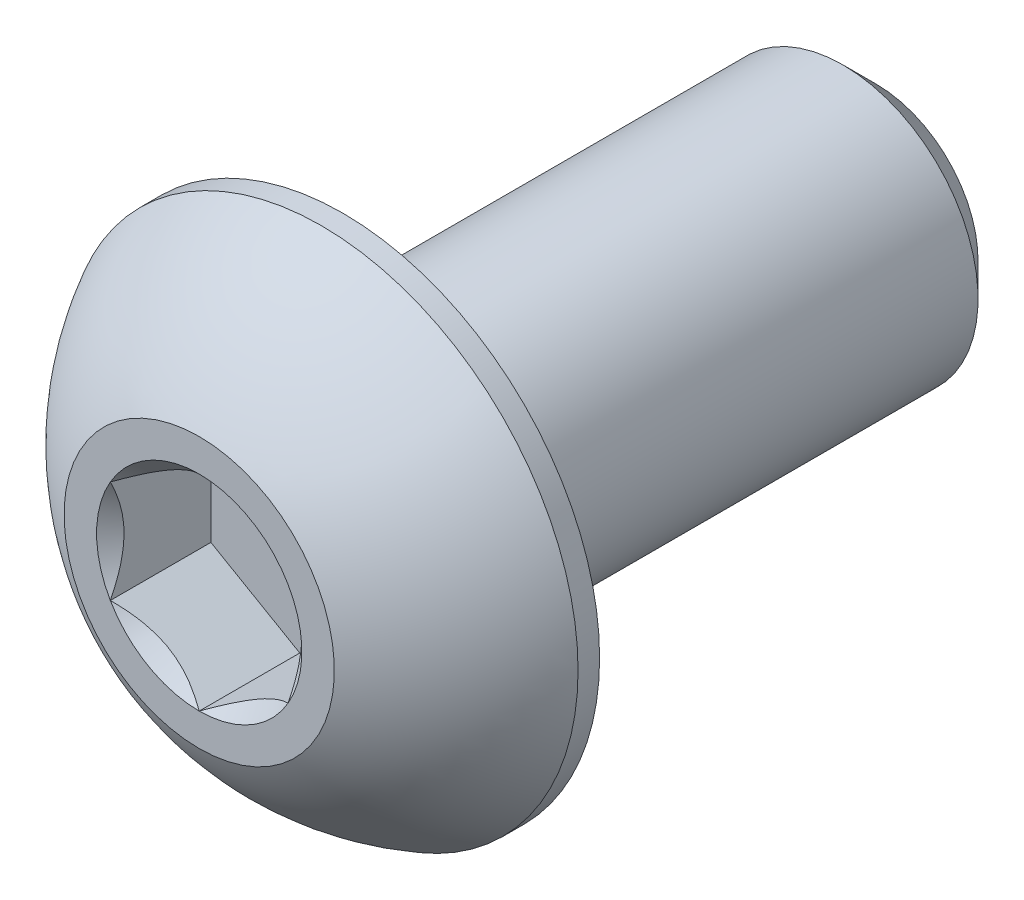
ISO-10303-21;
HEADER;
FILE_DESCRIPTION(('STEP AP214'),'2;1');
FILE_NAME('part.step','',(''),(''),'','','');
FILE_SCHEMA(('AUTOMOTIVE_DESIGN { 1 0 10303 214 1 1 1 1 }'));
ENDSEC;
DATA;
#1=APPLICATION_CONTEXT('core data for automotive mechanical design processes');
#2=APPLICATION_PROTOCOL_DEFINITION('international standard','automotive_design',2000,#1);
#3=PRODUCT_CONTEXT('',#1,'mechanical');
#4=PRODUCT('Part','Part','',(#3));
#5=PRODUCT_RELATED_PRODUCT_CATEGORY('part','',(#4));
#6=PRODUCT_DEFINITION_FORMATION('','',#4);
#7=PRODUCT_DEFINITION_CONTEXT('part definition',#1,'design');
#8=PRODUCT_DEFINITION('design','',#6,#7);
#9=PRODUCT_DEFINITION_SHAPE('','',#8);
#10=(LENGTH_UNIT() NAMED_UNIT(*) SI_UNIT(.MILLI.,.METRE.));
#11=(NAMED_UNIT(*) PLANE_ANGLE_UNIT() SI_UNIT($,.RADIAN.));
#12=(NAMED_UNIT(*) SI_UNIT($,.STERADIAN.) SOLID_ANGLE_UNIT());
#13=UNCERTAINTY_MEASURE_WITH_UNIT(LENGTH_MEASURE(1.E-05),#10,'distance_accuracy_value','');
#14=(GEOMETRIC_REPRESENTATION_CONTEXT(3) GLOBAL_UNCERTAINTY_ASSIGNED_CONTEXT((#13)) GLOBAL_UNIT_ASSIGNED_CONTEXT((#10,
#11,#12)) REPRESENTATION_CONTEXT('',''));
#15=CARTESIAN_POINT('',(0.,0.,0.));
#16=DIRECTION('',(0.,0.,1.));
#17=DIRECTION('',(1.,0.,0.));
#18=AXIS2_PLACEMENT_3D('',#15,#16,#17);
#19=CARTESIAN_POINT('',(0.,-2.41300000000001,-12.0904));
#20=DIRECTION('',(0.,0.,-1.));
#21=DIRECTION('',(0.,1.,0.));
#22=AXIS2_PLACEMENT_3D('',#19,#20,#21);
#23=PLANE('',#22);
#24=CARTESIAN_POINT('',(0.,0.,-12.0904));
#25=DIRECTION('',(0.,0.,-1.));
#26=DIRECTION('',(0.,1.,0.));
#27=AXIS2_PLACEMENT_3D('',#24,#25,#26);
#28=CIRCLE('',#27,1.8176875);
#29=CARTESIAN_POINT('',(0.,1.8176875,-12.0904));
#30=VERTEX_POINT('',#29);
#31=EDGE_CURVE('E43',#30,#30,#28,.T.);
#32=ORIENTED_EDGE('',*,*,#31,.T.);
#33=EDGE_LOOP('',(#32));
#34=FACE_BOUND('',#33,.T.);
#35=ADVANCED_FACE('F35',(#34),#23,.T.);
#36=CARTESIAN_POINT('',(0.,0.,-12.0904));
#37=DIRECTION('',(0.,0.,-1.));
#38=DIRECTION('',(0.,1.,0.));
#39=AXIS2_PLACEMENT_3D('',#36,#37,#38);
#40=CYLINDRICAL_SURFACE('',#39,2.41300000000001);
#41=CARTESIAN_POINT('',(0.,0.,-11.4950875));
#42=DIRECTION('',(0.,0.,-1.));
#43=DIRECTION('',(0.,1.,0.));
#44=AXIS2_PLACEMENT_3D('',#41,#42,#43);
#45=CIRCLE('',#44,2.41300000000001);
#46=CARTESIAN_POINT('',(0.,2.413,-11.4950875));
#47=VERTEX_POINT('',#46);
#48=EDGE_CURVE('E11',#47,#47,#45,.F.);
#49=ORIENTED_EDGE('',*,*,#48,.T.);
#50=EDGE_LOOP('',(#49));
#51=FACE_BOUND('',#50,.T.);
#52=CARTESIAN_POINT('',(0.,0.,-2.5654));
#53=DIRECTION('',(0.,0.,1.));
#54=DIRECTION('',(1.,0.,0.));
#55=AXIS2_PLACEMENT_3D('',#52,#53,#54);
#56=CIRCLE('',#55,2.41300000000001);
#57=CARTESIAN_POINT('',(2.41300000000001,0.,-2.5654));
#58=VERTEX_POINT('',#57);
#59=EDGE_CURVE('E169',#58,#58,#56,.F.);
#60=ORIENTED_EDGE('',*,*,#59,.T.);
#61=EDGE_LOOP('',(#60));
#62=FACE_BOUND('',#61,.T.);
#63=ADVANCED_FACE('F177',(#51,#62),#40,.T.);
#64=CARTESIAN_POINT('',(0.,0.,-12.0904));
#65=DIRECTION('',(0.,0.,1.));
#66=DIRECTION('',(0.,-1.,0.));
#67=AXIS2_PLACEMENT_3D('',#64,#65,#66);
#68=CONICAL_SURFACE('',#67,1.8176875,0.785398163397446);
#69=ORIENTED_EDGE('',*,*,#48,.F.);
#70=EDGE_LOOP('',(#69));
#71=FACE_BOUND('',#70,.T.);
#72=ORIENTED_EDGE('',*,*,#31,.F.);
#73=EDGE_LOOP('',(#72));
#74=FACE_BOUND('',#73,.T.);
#75=ADVANCED_FACE('F37',(#71,#74),#68,.T.);
#76=CARTESIAN_POINT('',(0.,0.,-4.5748806144438));
#77=DIRECTION('',(0.,0.,1.));
#78=DIRECTION('',(0.,-1.,0.));
#79=AXIS2_PLACEMENT_3D('',#76,#77,#78);
#80=SPHERICAL_SURFACE('',#79,5.17224338526463);
#81=CARTESIAN_POINT('',(0.,0.,0.));
#82=DIRECTION('',(0.,0.,1.));
#83=DIRECTION('',(1.,0.,0.));
#84=AXIS2_PLACEMENT_3D('',#81,#82,#83);
#85=CIRCLE('',#84,2.413);
#86=CARTESIAN_POINT('',(0.,-2.413,0.));
#87=VERTEX_POINT('',#86);
#88=EDGE_CURVE('E166',#87,#87,#85,.T.);
#89=CARTESIAN_POINT('',(0.,0.,-2.18059));
#90=DIRECTION('',(0.,0.,1.));
#91=DIRECTION('',(1.,0.,0.));
#92=AXIS2_PLACEMENT_3D('',#89,#90,#91);
#93=CIRCLE('',#92,4.5847);
#94=CARTESIAN_POINT('',(0.,-4.5847,-2.18059));
#95=VERTEX_POINT('',#94);
#96=EDGE_CURVE('E160',#95,#95,#93,.T.);
#97=CARTESIAN_POINT('',(0.,-2.413,0.));
#98=CARTESIAN_POINT('',(0.,-2.44179113663083,-0.0151857097788009));
#99=CARTESIAN_POINT('',(0.,-2.47043888331474,-0.0306432741933343));
#100=CARTESIAN_POINT('',(0.,-2.5274374690351,-0.0620964513369402));
#101=CARTESIAN_POINT('',(0.,-2.55578830807155,-0.0780920640660127));
#102=CARTESIAN_POINT('',(0.,-2.61218295074331,-0.110615676881771));
#103=CARTESIAN_POINT('',(0.,-2.64022675437863,-0.127143676968457));
#104=CARTESIAN_POINT('',(0.,-2.69599733629138,-0.160726162390165));
#105=CARTESIAN_POINT('',(0.,-2.72372411456882,-0.177780647725188));
#106=CARTESIAN_POINT('',(0.,-2.77885076121154,-0.21241002764294));
#107=CARTESIAN_POINT('',(0.,-2.80625062957682,-0.229984922225668));
#108=CARTESIAN_POINT('',(0.,-2.86071369040082,-0.265648855453746));
#109=CARTESIAN_POINT('',(0.,-2.88777688285954,-0.283737894099096));
#110=CARTESIAN_POINT('',(0.,-2.94155694533546,-0.320423667994127));
#111=CARTESIAN_POINT('',(0.,-2.96827381535265,-0.339020403243808));
#112=CARTESIAN_POINT('',(0.,-3.02135171000009,-0.37671494166065));
#113=CARTESIAN_POINT('',(0.,-3.04771273463033,-0.39581274482781));
#114=CARTESIAN_POINT('',(0.,-3.10006954235699,-0.434502611862808));
#115=CARTESIAN_POINT('',(0.,-3.12606532545341,-0.454094675730644));
#116=CARTESIAN_POINT('',(0.,-3.17768238416296,-0.493766080756604));
#117=CARTESIAN_POINT('',(0.,-3.20330365977609,-0.513845421914727));
#118=CARTESIAN_POINT('',(0.,-3.25416257105645,-0.554484224430573));
#119=CARTESIAN_POINT('',(0.,-3.27940020672367,-0.575043685788297));
#120=CARTESIAN_POINT('',(0.,-3.32948284239517,-0.616635400476975));
#121=CARTESIAN_POINT('',(0.,-3.35432784239946,-0.63766765380793));
#122=CARTESIAN_POINT('',(0.,-3.40361635097913,-0.680197455694829));
#123=CARTESIAN_POINT('',(0.,-3.42805985955453,-0.701695004250773));
#124=CARTESIAN_POINT('',(0.,-3.47653667261836,-0.745147733989217));
#125=CARTESIAN_POINT('',(0.,-3.5005699771068,-0.767102915171716));
#126=CARTESIAN_POINT('',(0.,-3.54821781555203,-0.81146308444603));
#127=CARTESIAN_POINT('',(0.,-3.57183234950881,-0.833868072537843));
#128=CARTESIAN_POINT('',(0.,-3.61863422971284,-0.879119869584105));
#129=CARTESIAN_POINT('',(0.,-3.64182157596008,-0.901966678538555));
#130=CARTESIAN_POINT('',(0.,-3.68776081583415,-0.948093973780533));
#131=CARTESIAN_POINT('',(0.,-3.71051270946098,-0.971374460068061));
#132=CARTESIAN_POINT('',(0.,-3.75557293439636,-1.01836081186645));
#133=CARTESIAN_POINT('',(0.,-3.7778812657049,-1.0420666773773));
#134=CARTESIAN_POINT('',(0.,-3.82204641440941,-1.08989533789018));
#135=CARTESIAN_POINT('',(0.,-3.84390323180538,-1.11401813289221));
#136=CARTESIAN_POINT('',(0.,-3.88715756202836,-1.16267205404467));
#137=CARTESIAN_POINT('',(0.,-3.90855507485536,-1.18720318019511));
#138=CARTESIAN_POINT('',(0.,-3.95088316899876,-1.23666501975588));
#139=CARTESIAN_POINT('',(0.,-3.97181375031515,-1.26159573316622));
#140=CARTESIAN_POINT('',(0.,-4.01320052092912,-1.31184786092909));
#141=CARTESIAN_POINT('',(0.,-4.03365671022669,-1.33716927528163));
#142=CARTESIAN_POINT('',(0.,-4.07408740538699,-1.38819377934977));
#143=CARTESIAN_POINT('',(0.,-4.09406191124973,-1.41389686906536));
#144=CARTESIAN_POINT('',(0.,-4.13352211981722,-1.46567556223513));
#145=CARTESIAN_POINT('',(0.,-4.15300782252198,-1.4917511656893));
#146=CARTESIAN_POINT('',(0.,-4.19148347927457,-1.54426559193551));
#147=CARTESIAN_POINT('',(0.,-4.2104734333224,-1.57070441472756));
#148=CARTESIAN_POINT('',(0.,-4.24795082398615,-1.6239358557723));
#149=CARTESIAN_POINT('',(0.,-4.26643826060207,-1.65072847402499));
#150=CARTESIAN_POINT('',(0.,-4.3029040266735,-1.70465795604563));
#151=CARTESIAN_POINT('',(0.,-4.32088235612901,-1.73179481981358));
#152=CARTESIAN_POINT('',(0.,-4.35632349988304,-1.78640312007115));
#153=CARTESIAN_POINT('',(0.,-4.37378631418156,-1.81387455656079));
#154=CARTESIAN_POINT('',(0.,-4.40819020238474,-1.86914221075438));
#155=CARTESIAN_POINT('',(0.,-4.42513127628939,-1.89693842845834));
#156=CARTESIAN_POINT('',(0.,-4.45848564813517,-1.95284573578717));
#157=CARTESIAN_POINT('',(0.,-4.4748989460763,-1.98095682541204));
#158=CARTESIAN_POINT('',(0.,-4.50719190474587,-2.03748386259807));
#159=CARTESIAN_POINT('',(0.,-4.5230715654743,-2.06589981015923));
#160=CARTESIAN_POINT('',(0.,-4.55429163018258,-2.12302641242262));
#161=CARTESIAN_POINT('',(0.,-4.56963203416241,-2.15173706712485));
#162=CARTESIAN_POINT('',(0.,-4.5847,-2.18059));
#163=B_SPLINE_CURVE_WITH_KNOTS('',3,(#97,#98,#99,#100,#101,#102,#103,#104,#105,#106,#107,#108,
#109,#110,#111,#112,#113,#114,#115,#116,#117,#118,#119,#120,#121,#122,#123,#124,#125,#126,#127,
#128,#129,#130,#131,#132,#133,#134,#135,#136,#137,#138,#139,#140,#141,#142,#143,#144,#145,#146,
#147,#148,#149,#150,#151,#152,#153,#154,#155,#156,#157,#158,#159,#160,#161,#162),.UNSPECIFIED.,
.F.,.F.,(4,2,2,2,2,2,2,2,2,2,2,2,2,2,2,2,2,2,2,2,2,2,2,2,2,2,2,2,2,2,2,2,4),(0.,
0.0976500604051489,0.195300120810298,0.292950181215447,0.390600241620598,0.488250302025747,
0.585900362430896,0.683550422836046,0.781200483241194,0.878850543646344,0.976500604051493,
1.07415066445664,1.17180072486179,1.26945078526694,1.36710084567209,1.46475090607724,
1.56240096648239,1.66005102688754,1.75770108729269,1.85535114769784,1.95300120810299,
2.05065126850814,2.14830132891329,2.24595138931843,2.34360144972358,2.44125151012873,
2.53890157053388,2.63655163093903,2.73420169134418,2.83185175174933,2.92950181215448,
3.02715187255963,3.12480193296478),.UNSPECIFIED.);
#164=EDGE_CURVE('BSEAM176',#87,#95,#163,.T.);
#165=ORIENTED_EDGE('',*,*,#88,.F.);
#166=ORIENTED_EDGE('',*,*,#96,.T.);
#167=ORIENTED_EDGE('',*,*,#164,.T.);
#168=ORIENTED_EDGE('',*,*,#164,.F.);
#169=EDGE_LOOP('',(#165,#167,#166,#168));
#170=FACE_BOUND('',#169,.T.);
#171=ADVANCED_FACE('F176',(#170),#80,.T.);
#172=CARTESIAN_POINT('',(0.,-2.413,0.));
#173=DIRECTION('',(0.,0.,-1.));
#174=DIRECTION('',(-1.,0.,0.));
#175=AXIS2_PLACEMENT_3D('',#172,#173,#174);
#176=PLANE('',#175);
#177=CARTESIAN_POINT('',(0.,0.,0.));
#178=DIRECTION('',(0.,0.,1.));
#179=DIRECTION('',(1.,0.,0.));
#180=AXIS2_PLACEMENT_3D('',#177,#178,#179);
#181=CIRCLE('',#180,1.83308710467706);
#182=CARTESIAN_POINT('',(-1.5875,0.91654355233853,0.));
#183=VERTEX_POINT('',#182);
#184=CARTESIAN_POINT('',(-1.5875,-0.916543552338531,0.));
#185=VERTEX_POINT('',#184);
#186=EDGE_CURVE('E56',#183,#185,#181,.T.);
#187=ORIENTED_EDGE('',*,*,#186,.F.);
#188=CARTESIAN_POINT('',(0.,1.83308710467706,0.));
#189=VERTEX_POINT('',#188);
#190=EDGE_CURVE('E130',#189,#183,#181,.T.);
#191=ORIENTED_EDGE('',*,*,#190,.F.);
#192=CARTESIAN_POINT('',(1.5875,0.916543552338531,0.));
#193=VERTEX_POINT('',#192);
#194=EDGE_CURVE('E107',#193,#189,#181,.T.);
#195=ORIENTED_EDGE('',*,*,#194,.F.);
#196=CARTESIAN_POINT('',(1.5875,-0.916543552338531,0.));
#197=VERTEX_POINT('',#196);
#198=EDGE_CURVE('E96',#197,#193,#181,.T.);
#199=ORIENTED_EDGE('',*,*,#198,.F.);
#200=CARTESIAN_POINT('',(0.,-1.83308710467706,0.));
#201=VERTEX_POINT('',#200);
#202=EDGE_CURVE('E88',#201,#197,#181,.T.);
#203=ORIENTED_EDGE('',*,*,#202,.F.);
#204=EDGE_CURVE('E49',#185,#201,#181,.T.);
#205=ORIENTED_EDGE('',*,*,#204,.F.);
#206=EDGE_LOOP('',(#187,#191,#195,#199,#203,#205));
#207=FACE_BOUND('',#206,.T.);
#208=ORIENTED_EDGE('',*,*,#88,.T.);
#209=EDGE_LOOP('',(#208));
#210=FACE_BOUND('',#209,.T.);
#211=ADVANCED_FACE('F127',(#207,#210),#176,.F.);
#212=CARTESIAN_POINT('',(0.,-4.5847,-2.5654));
#213=DIRECTION('',(0.,0.,1.));
#214=DIRECTION('',(1.,0.,0.));
#215=AXIS2_PLACEMENT_3D('',#212,#213,#214);
#216=PLANE('',#215);
#217=ORIENTED_EDGE('',*,*,#59,.F.);
#218=EDGE_LOOP('',(#217));
#219=FACE_BOUND('',#218,.T.);
#220=CARTESIAN_POINT('',(0.,0.,-2.5654));
#221=DIRECTION('',(0.,0.,1.));
#222=DIRECTION('',(1.,0.,0.));
#223=AXIS2_PLACEMENT_3D('',#220,#221,#222);
#224=CIRCLE('',#223,4.5847);
#225=CARTESIAN_POINT('',(4.5847,0.,-2.5654));
#226=VERTEX_POINT('',#225);
#227=EDGE_CURVE('E163',#226,#226,#224,.T.);
#228=ORIENTED_EDGE('',*,*,#227,.F.);
#229=EDGE_LOOP('',(#228));
#230=FACE_BOUND('',#229,.T.);
#231=ADVANCED_FACE('F194',(#219,#230),#216,.F.);
#232=CARTESIAN_POINT('',(0.,0.,0.));
#233=DIRECTION('',(0.,0.,1.));
#234=DIRECTION('',(1.,0.,0.));
#235=AXIS2_PLACEMENT_3D('',#232,#233,#234);
#236=CYLINDRICAL_SURFACE('',#235,4.5847);
#237=ORIENTED_EDGE('',*,*,#96,.F.);
#238=EDGE_LOOP('',(#237));
#239=FACE_BOUND('',#238,.T.);
#240=ORIENTED_EDGE('',*,*,#227,.T.);
#241=EDGE_LOOP('',(#240));
#242=FACE_BOUND('',#241,.T.);
#243=ADVANCED_FACE('F197',(#239,#242),#236,.T.);
#244=CARTESIAN_POINT('',(0.,0.,0.));
#245=DIRECTION('',(0.,0.,1.));
#246=DIRECTION('',(1.,0.,0.));
#247=AXIS2_PLACEMENT_3D('',#244,#245,#246);
#248=CONICAL_SURFACE('',#247,1.83308710467706,0.78539816339745);
#249=ORIENTED_EDGE('',*,*,#198,.T.);
#250=CARTESIAN_POINT('',(1.5875,-1.83163614232865,0.590762562254565));
#251=CARTESIAN_POINT('',(1.5875,-1.78705354844902,0.55707785480324));
#252=CARTESIAN_POINT('',(1.5875,-1.74222294150555,0.523722329968627));
#253=CARTESIAN_POINT('',(1.5875,-1.65196486784504,0.457805675888285));
#254=CARTESIAN_POINT('',(1.5875,-1.60653725449665,0.425244747634468));
#255=CARTESIAN_POINT('',(1.5875,-1.46854281940082,0.328493449461236));
#256=CARTESIAN_POINT('',(1.5875,-1.37494211623386,0.265753264612858));
#257=CARTESIAN_POINT('',(1.5875,-1.17864136265695,0.142553151294645));
#258=CARTESIAN_POINT('',(1.5875,-1.07572731596385,0.0824303289226488));
#259=CARTESIAN_POINT('',(1.5875,-0.864754189558117,-0.0275706334490079));
#260=CARTESIAN_POINT('',(1.5875,-0.756714033301438,-0.0774833149376714));
#261=CARTESIAN_POINT('',(1.5875,-0.594580029688666,-0.138547963751185));
#262=CARTESIAN_POINT('',(1.5875,-0.542894373932897,-0.156067797502568));
#263=CARTESIAN_POINT('',(1.5875,-0.43827206291756,-0.186958420156953));
#264=CARTESIAN_POINT('',(1.5875,-0.3853353220534,-0.200328924255393));
#265=CARTESIAN_POINT('',(1.5875,-0.27941340073437,-0.222002681044568));
#266=CARTESIAN_POINT('',(1.5875,-0.226446313904206,-0.230392976800141));
#267=CARTESIAN_POINT('',(1.5875,-0.119941637592404,-0.241941911012322));
#268=CARTESIAN_POINT('',(1.5875,-0.0664041486263234,-0.245101456366562));
#269=CARTESIAN_POINT('',(1.5875,0.0387581192420279,-0.245952982965122));
#270=CARTESIAN_POINT('',(1.5875,0.090381381554216,-0.243840334608509));
#271=CARTESIAN_POINT('',(1.5875,0.19318730201683,-0.234695846678065));
#272=CARTESIAN_POINT('',(1.5875,0.244369916988517,-0.227663530460197));
#273=CARTESIAN_POINT('',(1.5875,0.346790527788956,-0.208944949355169));
#274=CARTESIAN_POINT('',(1.5875,0.398013804172139,-0.197179358640977));
#275=CARTESIAN_POINT('',(1.5875,0.499340680307276,-0.169620657149212));
#276=CARTESIAN_POINT('',(1.5875,0.549444372105894,-0.153827878801824));
#277=CARTESIAN_POINT('',(1.5875,0.707022639586407,-0.0982133790717417));
#278=CARTESIAN_POINT('',(1.5875,0.812258737570578,-0.0520647672653368));
#279=CARTESIAN_POINT('',(1.5875,1.01778869013701,0.0505458403808823));
#280=CARTESIAN_POINT('',(1.5875,1.11806310933257,0.107044855107553));
#281=CARTESIAN_POINT('',(1.5875,1.30970442577157,0.223612502972616));
#282=CARTESIAN_POINT('',(1.5875,1.40126637149297,0.283364441978613));
#283=CARTESIAN_POINT('',(1.5875,1.53616443073864,0.37573700869171));
#284=CARTESIAN_POINT('',(1.5875,1.58054835823549,0.406854014274728));
#285=CARTESIAN_POINT('',(1.5875,1.66870952512132,0.469911550181166));
#286=CARTESIAN_POINT('',(1.5875,1.71248692801697,0.501851851647461));
#287=CARTESIAN_POINT('',(1.5875,1.75601179240957,0.534133557847131));
#288=B_SPLINE_CURVE_WITH_KNOTS('',3,(#250,#251,#252,#253,#254,#255,#256,#257,#258,#259,#260,
#261,#262,#263,#264,#265,#266,#267,#268,#269,#270,#271,#272,#273,#274,#275,#276,#277,#278,#279,
#280,#281,#282,#283,#284,#285,#286,#287),.UNSPECIFIED.,.F.,.F.,(4,2,2,2,2,2,2,2,2,2,2,2,2,2,2,2,
2,2,4),(0.,0.167627505127548,0.33529698084648,0.673194674702938,1.0304700708717,
1.38651603079307,1.55010049300858,1.71369618096554,1.87434127467533,2.034958513124,
2.18971280484453,2.34448209207484,2.50196108385089,2.65942708049529,3.00314617711216,
3.34811949873714,3.6759579216973,3.83856722085481,4.00113179576279),.UNSPECIFIED.);
#289=EDGE_CURVE('E101',#197,#193,#288,.T.);
#290=ORIENTED_EDGE('',*,*,#289,.F.);
#291=EDGE_LOOP('',(#249,#290));
#292=FACE_BOUND('',#291,.T.);
#293=ADVANCED_FACE('F102',(#292),#248,.F.);
#294=ORIENTED_EDGE('',*,*,#194,.T.);
#295=CARTESIAN_POINT('',(1.5877,0.916428082284693,0.000115480963706964));
#296=CARTESIAN_POINT('',(1.53312479190086,0.947937093371809,-0.0313691916294028));
#297=CARTESIAN_POINT('',(1.47763696320971,0.979973006203395,-0.0610049539864698));
#298=CARTESIAN_POINT('',(1.36449087915364,1.04529792829092,-0.115267739979175));
#299=CARTESIAN_POINT('',(1.30682185887062,1.07859315267522,-0.139864564866823));
#300=CARTESIAN_POINT('',(1.1905349781269,1.14573141457583,-0.181999635727418));
#301=CARTESIAN_POINT('',(1.13194674474407,1.17955734689075,-0.199643807270178));
#302=CARTESIAN_POINT('',(1.01348022674557,1.24795402294714,-0.226828529915031));
#303=CARTESIAN_POINT('',(0.953605562983896,1.28252267618758,-0.236389379304923));
#304=CARTESIAN_POINT('',(0.850418771876558,1.34209759781022,-0.245015586895992));
#305=CARTESIAN_POINT('',(0.807240015952288,1.36702686416637,-0.246292807190424));
#306=CARTESIAN_POINT('',(0.720953038535399,1.41684467380557,-0.244142944185295));
#307=CARTESIAN_POINT('',(0.677844847078612,1.44173319974742,-0.240714211450657));
#308=CARTESIAN_POINT('',(0.592046335002031,1.49126899379091,-0.229349005566657));
#309=CARTESIAN_POINT('',(0.549356408925407,1.51591603410293,-0.221408628198358));
#310=CARTESIAN_POINT('',(0.464693063478359,1.56479643938728,-0.201451585548899));
#311=CARTESIAN_POINT('',(0.422719959755075,1.58902962212064,-0.189433170791309));
#312=CARTESIAN_POINT('',(0.315211458113566,1.65109968448354,-0.153753102752754));
#313=CARTESIAN_POINT('',(0.2503427717089,1.68855163804125,-0.127401427696863));
#314=CARTESIAN_POINT('',(0.154961599380924,1.74361998356043,-0.082916463148298));
#315=CARTESIAN_POINT('',(0.123530699536157,1.76176662204668,-0.0672871421988686));
#316=CARTESIAN_POINT('',(0.0612469855696368,1.79772614107138,-0.0346015121388987));
#317=CARTESIAN_POINT('',(0.0303939039605763,1.8155391760437,-0.0175458843430302));
#318=CARTESIAN_POINT('',(-0.000200000000000412,1.8332025747309,0.000115480963706783));
#319=B_SPLINE_CURVE_WITH_KNOTS('',3,(#295,#296,#297,#298,#299,#300,#301,#302,#303,#304,#305,
#306,#307,#308,#309,#310,#311,#312,#313,#314,#315,#316,#317,#318),.UNSPECIFIED.,.F.,.F.,(4,2,2,
2,2,2,2,2,2,2,2,4),(0.,0.211482650810816,0.424197870807275,0.633533884524815,0.842342653263348,
0.99175555372714,1.14122083674204,1.29081565918877,1.44047473906437,1.6781878086972,
1.79671410024894,1.91518409436631),.UNSPECIFIED.);
#320=EDGE_CURVE('E106',#193,#189,#319,.T.);
#321=ORIENTED_EDGE('',*,*,#320,.F.);
#322=EDGE_LOOP('',(#294,#321));
#323=FACE_BOUND('',#322,.T.);
#324=ADVANCED_FACE('F282',(#323),#248,.F.);
#325=ORIENTED_EDGE('',*,*,#190,.T.);
#326=CARTESIAN_POINT('',(0.000199999999999602,1.8332025747309,0.000115480963706835));
#327=CARTESIAN_POINT('',(-0.0543752080991368,1.80169356364378,-0.031369191629403));
#328=CARTESIAN_POINT('',(-0.10986303679029,1.7696576508122,-0.06100495398647));
#329=CARTESIAN_POINT('',(-0.223009120846359,1.70433272872467,-0.115267739979175));
#330=CARTESIAN_POINT('',(-0.280678141129381,1.67103750434037,-0.139864564866824));
#331=CARTESIAN_POINT('',(-0.396965021873103,1.60389924243976,-0.181999635727418));
#332=CARTESIAN_POINT('',(-0.455553255255931,1.57007331012484,-0.199643807270178));
#333=CARTESIAN_POINT('',(-0.574019773254431,1.50167663406845,-0.226828529915031));
#334=CARTESIAN_POINT('',(-0.633894437016105,1.46710798082801,-0.236389379304923));
#335=CARTESIAN_POINT('',(-0.737081228123443,1.40753305920537,-0.245015586895992));
#336=CARTESIAN_POINT('',(-0.780259984047713,1.38260379284922,-0.246292807190424));
#337=CARTESIAN_POINT('',(-0.866546961464602,1.33278598321002,-0.244142944185295));
#338=CARTESIAN_POINT('',(-0.909655152921388,1.30789745726817,-0.240714211450657));
#339=CARTESIAN_POINT('',(-0.99545366499797,1.25836166322468,-0.229349005566657));
#340=CARTESIAN_POINT('',(-1.03814359107459,1.23371462291266,-0.221408628198358));
#341=CARTESIAN_POINT('',(-1.12280693652164,1.18483421762831,-0.201451585548899));
#342=CARTESIAN_POINT('',(-1.16478004024493,1.16060103489495,-0.189433170791309));
#343=CARTESIAN_POINT('',(-1.27228854188643,1.09853097253205,-0.153753102752754));
#344=CARTESIAN_POINT('',(-1.3371572282911,1.06107901897434,-0.127401427696863));
#345=CARTESIAN_POINT('',(-1.43253840061908,1.00601067345516,-0.082916463148298));
#346=CARTESIAN_POINT('',(-1.46396930046384,0.987864034968913,-0.0672871421988685));
#347=CARTESIAN_POINT('',(-1.52625301443036,0.951904515944214,-0.0346015121388985));
#348=CARTESIAN_POINT('',(-1.55710609603942,0.934091480971893,-0.0175458843430301));
#349=CARTESIAN_POINT('',(-1.5877,0.916428082284692,0.000115480963706555));
#350=B_SPLINE_CURVE_WITH_KNOTS('',3,(#326,#327,#328,#329,#330,#331,#332,#333,#334,#335,#336,
#337,#338,#339,#340,#341,#342,#343,#344,#345,#346,#347,#348,#349),.UNSPECIFIED.,.F.,.F.,(4,2,2,
2,2,2,2,2,2,2,2,4),(0.,0.211482650810816,0.424197870807276,0.633533884524816,0.842342653263348,
0.991755553727141,1.14122083674205,1.29081565918877,1.44047473906438,1.6781878086972,
1.79671410024894,1.91518409436631),.UNSPECIFIED.);
#351=EDGE_CURVE('E137',#189,#183,#350,.T.);
#352=ORIENTED_EDGE('',*,*,#351,.F.);
#353=EDGE_LOOP('',(#325,#352));
#354=FACE_BOUND('',#353,.T.);
#355=ADVANCED_FACE('F135',(#354),#248,.F.);
#356=ORIENTED_EDGE('',*,*,#186,.T.);
#357=CARTESIAN_POINT('',(-1.5875,-1.83163614232865,0.590762562254564));
#358=CARTESIAN_POINT('',(-1.5875,-1.78705354844902,0.557077854803239));
#359=CARTESIAN_POINT('',(-1.5875,-1.74222294150555,0.523722329968626));
#360=CARTESIAN_POINT('',(-1.5875,-1.65196486784504,0.457805675888285));
#361=CARTESIAN_POINT('',(-1.5875,-1.60653725449665,0.425244747634468));
#362=CARTESIAN_POINT('',(-1.5875,-1.46854281940082,0.328493449461235));
#363=CARTESIAN_POINT('',(-1.5875,-1.37494211623386,0.265753264612857));
#364=CARTESIAN_POINT('',(-1.5875,-1.17864136265695,0.142553151294644));
#365=CARTESIAN_POINT('',(-1.5875,-1.07572731596385,0.0824303289226486));
#366=CARTESIAN_POINT('',(-1.5875,-0.864754189558117,-0.0275706334490081));
#367=CARTESIAN_POINT('',(-1.5875,-0.756714033301438,-0.0774833149376718));
#368=CARTESIAN_POINT('',(-1.5875,-0.594580029688666,-0.138547963751185));
#369=CARTESIAN_POINT('',(-1.5875,-0.542894373932898,-0.156067797502568));
#370=CARTESIAN_POINT('',(-1.5875,-0.438272062917561,-0.186958420156953));
#371=CARTESIAN_POINT('',(-1.5875,-0.385335322053401,-0.200328924255393));
#372=CARTESIAN_POINT('',(-1.5875,-0.27941340073437,-0.222002681044568));
#373=CARTESIAN_POINT('',(-1.5875,-0.226446313904207,-0.230392976800141));
#374=CARTESIAN_POINT('',(-1.5875,-0.119941637592405,-0.241941911012322));
#375=CARTESIAN_POINT('',(-1.5875,-0.0664041486263238,-0.245101456366562));
#376=CARTESIAN_POINT('',(-1.5875,0.0387581192420274,-0.245952982965122));
#377=CARTESIAN_POINT('',(-1.5875,0.0903813815542156,-0.243840334608509));
#378=CARTESIAN_POINT('',(-1.5875,0.193187302016829,-0.234695846678065));
#379=CARTESIAN_POINT('',(-1.5875,0.244369916988516,-0.227663530460197));
#380=CARTESIAN_POINT('',(-1.5875,0.346790527788956,-0.208944949355169));
#381=CARTESIAN_POINT('',(-1.5875,0.398013804172139,-0.197179358640977));
#382=CARTESIAN_POINT('',(-1.5875,0.499340680307276,-0.169620657149213));
#383=CARTESIAN_POINT('',(-1.5875,0.549444372105893,-0.153827878801824));
#384=CARTESIAN_POINT('',(-1.5875,0.707022639586407,-0.0982133790717423));
#385=CARTESIAN_POINT('',(-1.5875,0.812258737570577,-0.0520647672653372));
#386=CARTESIAN_POINT('',(-1.5875,1.01778869013701,0.050545840380882));
#387=CARTESIAN_POINT('',(-1.5875,1.11806310933256,0.107044855107552));
#388=CARTESIAN_POINT('',(-1.5875,1.30970442577157,0.223612502972616));
#389=CARTESIAN_POINT('',(-1.5875,1.40126637149297,0.283364441978612));
#390=CARTESIAN_POINT('',(-1.5875,1.53616443073864,0.375737008691709));
#391=CARTESIAN_POINT('',(-1.5875,1.58054835823549,0.406854014274727));
#392=CARTESIAN_POINT('',(-1.5875,1.66870952512132,0.469911550181165));
#393=CARTESIAN_POINT('',(-1.5875,1.71248692801697,0.50185185164746));
#394=CARTESIAN_POINT('',(-1.5875,1.75601179240957,0.53413355784713));
#395=B_SPLINE_CURVE_WITH_KNOTS('',3,(#357,#358,#359,#360,#361,#362,#363,#364,#365,#366,#367,
#368,#369,#370,#371,#372,#373,#374,#375,#376,#377,#378,#379,#380,#381,#382,#383,#384,#385,#386,
#387,#388,#389,#390,#391,#392,#393,#394),.UNSPECIFIED.,.F.,.F.,(4,2,2,2,2,2,2,2,2,2,2,2,2,2,2,2,
2,2,4),(0.,0.167627505127548,0.335296980846479,0.673194674702938,1.0304700708717,
1.38651603079307,1.55010049300858,1.71369618096554,1.87434127467533,2.034958513124,
2.18971280484453,2.34448209207484,2.50196108385089,2.65942708049529,3.00314617711216,
3.34811949873714,3.67595792169729,3.83856722085481,4.00113179576279),.UNSPECIFIED.);
#396=EDGE_CURVE('E141',#183,#185,#395,.F.);
#397=ORIENTED_EDGE('',*,*,#396,.F.);
#398=EDGE_LOOP('',(#356,#397));
#399=FACE_BOUND('',#398,.T.);
#400=ADVANCED_FACE('F276',(#399),#248,.F.);
#401=ORIENTED_EDGE('',*,*,#204,.T.);
#402=CARTESIAN_POINT('',(-1.5877,-0.916428082284693,0.000115480963706531));
#403=CARTESIAN_POINT('',(-1.53312479190086,-0.947937093371809,-0.0313691916294031));
#404=CARTESIAN_POINT('',(-1.47763696320971,-0.979973006203394,-0.06100495398647));
#405=CARTESIAN_POINT('',(-1.36449087915364,-1.04529792829092,-0.115267739979175));
#406=CARTESIAN_POINT('',(-1.30682185887062,-1.07859315267522,-0.139864564866824));
#407=CARTESIAN_POINT('',(-1.1905349781269,-1.14573141457583,-0.181999635727418));
#408=CARTESIAN_POINT('',(-1.13194674474407,-1.17955734689075,-0.199643807270178));
#409=CARTESIAN_POINT('',(-1.01348022674557,-1.24795402294714,-0.226828529915031));
#410=CARTESIAN_POINT('',(-0.953605562983895,-1.28252267618758,-0.236389379304923));
#411=CARTESIAN_POINT('',(-0.850418771876558,-1.34209759781022,-0.245015586895992));
#412=CARTESIAN_POINT('',(-0.807240015952288,-1.36702686416637,-0.246292807190424));
#413=CARTESIAN_POINT('',(-0.720953038535399,-1.41684467380557,-0.244142944185295));
#414=CARTESIAN_POINT('',(-0.677844847078612,-1.44173319974742,-0.240714211450657));
#415=CARTESIAN_POINT('',(-0.592046335002031,-1.49126899379091,-0.229349005566657));
#416=CARTESIAN_POINT('',(-0.549356408925407,-1.51591603410293,-0.221408628198358));
#417=CARTESIAN_POINT('',(-0.464693063478359,-1.56479643938728,-0.201451585548899));
#418=CARTESIAN_POINT('',(-0.422719959755075,-1.58902962212064,-0.189433170791309));
#419=CARTESIAN_POINT('',(-0.315211458113566,-1.65109968448354,-0.153753102752754));
#420=CARTESIAN_POINT('',(-0.2503427717089,-1.68855163804125,-0.127401427696864));
#421=CARTESIAN_POINT('',(-0.154961599380924,-1.74361998356043,-0.082916463148298));
#422=CARTESIAN_POINT('',(-0.123530699536156,-1.76176662204668,-0.0672871421988684));
#423=CARTESIAN_POINT('',(-0.0612469855696366,-1.79772614107138,-0.0346015121388983));
#424=CARTESIAN_POINT('',(-0.030393903960576,-1.8155391760437,-0.0175458843430298));
#425=CARTESIAN_POINT('',(0.000200000000000753,-1.8332025747309,0.000115480963706965));
#426=B_SPLINE_CURVE_WITH_KNOTS('',3,(#402,#403,#404,#405,#406,#407,#408,#409,#410,#411,#412,
#413,#414,#415,#416,#417,#418,#419,#420,#421,#422,#423,#424,#425),.UNSPECIFIED.,.F.,.F.,(4,2,2,
2,2,2,2,2,2,2,2,4),(0.,0.211482650810816,0.424197870807275,0.633533884524815,0.842342653263347,
0.99175555372714,1.14122083674204,1.29081565918877,1.44047473906437,1.6781878086972,
1.79671410024894,1.91518409436631),.UNSPECIFIED.);
#427=EDGE_CURVE('E117',#185,#201,#426,.T.);
#428=ORIENTED_EDGE('',*,*,#427,.F.);
#429=EDGE_LOOP('',(#401,#428));
#430=FACE_BOUND('',#429,.T.);
#431=ADVANCED_FACE('F224',(#430),#248,.F.);
#432=ORIENTED_EDGE('',*,*,#202,.T.);
#433=CARTESIAN_POINT('',(-0.000199999999999123,-1.8332025747309,0.000115480963707269));
#434=CARTESIAN_POINT('',(0.0543752080991372,-1.80169356364378,-0.0313691916294027));
#435=CARTESIAN_POINT('',(0.109863036790291,-1.7696576508122,-0.0610049539864697));
#436=CARTESIAN_POINT('',(0.22300912084636,-1.70433272872467,-0.115267739979174));
#437=CARTESIAN_POINT('',(0.280678141129382,-1.67103750434037,-0.139864564866823));
#438=CARTESIAN_POINT('',(0.396965021873104,-1.60389924243976,-0.181999635727418));
#439=CARTESIAN_POINT('',(0.455553255255932,-1.57007331012484,-0.199643807270178));
#440=CARTESIAN_POINT('',(0.574019773254432,-1.50167663406845,-0.226828529915031));
#441=CARTESIAN_POINT('',(0.633894437016106,-1.46710798082801,-0.236389379304922));
#442=CARTESIAN_POINT('',(0.737081228123443,-1.40753305920537,-0.245015586895992));
#443=CARTESIAN_POINT('',(0.780259984047713,-1.38260379284922,-0.246292807190423));
#444=CARTESIAN_POINT('',(0.866546961464602,-1.33278598321002,-0.244142944185295));
#445=CARTESIAN_POINT('',(0.909655152921389,-1.30789745726817,-0.240714211450656));
#446=CARTESIAN_POINT('',(0.99545366499797,-1.25836166322468,-0.229349005566656));
#447=CARTESIAN_POINT('',(1.03814359107459,-1.23371462291266,-0.221408628198358));
#448=CARTESIAN_POINT('',(1.12280693652164,-1.18483421762831,-0.201451585548898));
#449=CARTESIAN_POINT('',(1.16478004024493,-1.16060103489495,-0.189433170791309));
#450=CARTESIAN_POINT('',(1.27228854188643,-1.09853097253205,-0.153753102752754));
#451=CARTESIAN_POINT('',(1.3371572282911,-1.06107901897434,-0.127401427696863));
#452=CARTESIAN_POINT('',(1.43253840061908,-1.00601067345516,-0.0829164631482976));
#453=CARTESIAN_POINT('',(1.46396930046384,-0.987864034968914,-0.0672871421988682));
#454=CARTESIAN_POINT('',(1.52625301443036,-0.951904515944214,-0.0346015121388983));
#455=CARTESIAN_POINT('',(1.55710609603942,-0.934091480971893,-0.0175458843430299));
#456=CARTESIAN_POINT('',(1.5877,-0.916428082284693,0.000115480963706771));
#457=B_SPLINE_CURVE_WITH_KNOTS('',3,(#433,#434,#435,#436,#437,#438,#439,#440,#441,#442,#443,
#444,#445,#446,#447,#448,#449,#450,#451,#452,#453,#454,#455,#456),.UNSPECIFIED.,.F.,.F.,(4,2,2,
2,2,2,2,2,2,2,2,4),(0.,0.211482650810816,0.424197870807276,0.633533884524815,0.842342653263348,
0.991755553727141,1.14122083674205,1.29081565918877,1.44047473906438,1.6781878086972,
1.79671410024894,1.91518409436631),.UNSPECIFIED.);
#458=EDGE_CURVE('E92',#201,#197,#457,.T.);
#459=ORIENTED_EDGE('',*,*,#458,.F.);
#460=EDGE_LOOP('',(#432,#459));
#461=FACE_BOUND('',#460,.T.);
#462=ADVANCED_FACE('F90',(#461),#248,.F.);
#463=CARTESIAN_POINT('',(1.5875,-0.916543552338531,-1.79578));
#464=DIRECTION('',(0.,0.,1.));
#465=DIRECTION('',(1.,0.,0.));
#466=AXIS2_PLACEMENT_3D('',#463,#464,#465);
#467=PLANE('',#466);
#468=DIRECTION('',(0.866025403784438,0.5,0.));
#469=VECTOR('',#468,1.);
#470=CARTESIAN_POINT('',(0.,-1.83308710467706,-1.79578));
#471=LINE('',#470,#469);
#472=CARTESIAN_POINT('',(0.,-1.83308710467706,-1.79578));
#473=VERTEX_POINT('',#472);
#474=CARTESIAN_POINT('',(1.5875,-0.916543552338531,-1.79578));
#475=VERTEX_POINT('',#474);
#476=EDGE_CURVE('E116',#473,#475,#471,.T.);
#477=ORIENTED_EDGE('',*,*,#476,.T.);
#478=DIRECTION('',(0.,1.,0.));
#479=VECTOR('',#478,1.);
#480=CARTESIAN_POINT('',(1.5875,-0.916543552338531,-1.79578));
#481=LINE('',#480,#479);
#482=CARTESIAN_POINT('',(1.5875,0.916543552338531,-1.79578));
#483=VERTEX_POINT('',#482);
#484=EDGE_CURVE('E121',#475,#483,#481,.T.);
#485=ORIENTED_EDGE('',*,*,#484,.T.);
#486=DIRECTION('',(-0.866025403784439,0.5,0.));
#487=VECTOR('',#486,1.);
#488=CARTESIAN_POINT('',(1.5875,0.916543552338531,-1.79578));
#489=LINE('',#488,#487);
#490=CARTESIAN_POINT('',(0.,1.83308710467706,-1.79578));
#491=VERTEX_POINT('',#490);
#492=EDGE_CURVE('E266',#483,#491,#489,.T.);
#493=ORIENTED_EDGE('',*,*,#492,.T.);
#494=DIRECTION('',(-0.866025403784438,-0.5,0.));
#495=VECTOR('',#494,1.);
#496=CARTESIAN_POINT('',(0.,1.83308710467706,-1.79578));
#497=LINE('',#496,#495);
#498=CARTESIAN_POINT('',(-1.5875,0.91654355233853,-1.79578));
#499=VERTEX_POINT('',#498);
#500=EDGE_CURVE('E151',#491,#499,#497,.T.);
#501=ORIENTED_EDGE('',*,*,#500,.T.);
#502=DIRECTION('',(0.,-1.,0.));
#503=VECTOR('',#502,1.);
#504=CARTESIAN_POINT('',(-1.5875,0.91654355233853,-1.79578));
#505=LINE('',#504,#503);
#506=CARTESIAN_POINT('',(-1.5875,-0.916543552338531,-1.79578));
#507=VERTEX_POINT('',#506);
#508=EDGE_CURVE('E270',#499,#507,#505,.T.);
#509=ORIENTED_EDGE('',*,*,#508,.T.);
#510=DIRECTION('',(0.866025403784439,-0.5,0.));
#511=VECTOR('',#510,1.);
#512=CARTESIAN_POINT('',(-1.5875,-0.916543552338531,-1.79578));
#513=LINE('',#512,#511);
#514=EDGE_CURVE('E124',#507,#473,#513,.T.);
#515=ORIENTED_EDGE('',*,*,#514,.T.);
#516=EDGE_LOOP('',(#477,#485,#493,#501,#509,#515));
#517=FACE_BOUND('',#516,.T.);
#518=ADVANCED_FACE('F223',(#517),#467,.T.);
#519=CARTESIAN_POINT('',(1.5875,-0.916543552338531,-1.79578));
#520=DIRECTION('',(1.,0.,0.));
#521=DIRECTION('',(0.,0.,-1.));
#522=AXIS2_PLACEMENT_3D('',#519,#520,#521);
#523=PLANE('',#522);
#524=DIRECTION('',(0.,0.,1.));
#525=VECTOR('',#524,1.);
#526=CARTESIAN_POINT('',(1.5875,-0.916543552338531,-1.79578));
#527=LINE('',#526,#525);
#528=EDGE_CURVE('E113',#475,#197,#527,.T.);
#529=ORIENTED_EDGE('',*,*,#528,.T.);
#530=ORIENTED_EDGE('',*,*,#289,.T.);
#531=DIRECTION('',(0.,0.,1.));
#532=VECTOR('',#531,1.);
#533=CARTESIAN_POINT('',(1.5875,0.916543552338531,-1.79578));
#534=LINE('',#533,#532);
#535=EDGE_CURVE('E123',#483,#193,#534,.T.);
#536=ORIENTED_EDGE('',*,*,#535,.F.);
#537=ORIENTED_EDGE('',*,*,#484,.F.);
#538=EDGE_LOOP('',(#529,#530,#536,#537));
#539=FACE_BOUND('',#538,.T.);
#540=ADVANCED_FACE('F119',(#539),#523,.F.);
#541=CARTESIAN_POINT('',(1.5875,0.916543552338531,-1.79578));
#542=DIRECTION('',(0.5,0.866025403784439,0.));
#543=DIRECTION('',(-0.866025403784439,0.5,0.));
#544=AXIS2_PLACEMENT_3D('',#541,#542,#543);
#545=PLANE('',#544);
#546=ORIENTED_EDGE('',*,*,#535,.T.);
#547=ORIENTED_EDGE('',*,*,#320,.T.);
#548=DIRECTION('',(0.,0.,1.));
#549=VECTOR('',#548,1.);
#550=CARTESIAN_POINT('',(0.,1.83308710467706,-1.79578));
#551=LINE('',#550,#549);
#552=EDGE_CURVE('E146',#491,#189,#551,.T.);
#553=ORIENTED_EDGE('',*,*,#552,.F.);
#554=ORIENTED_EDGE('',*,*,#492,.F.);
#555=EDGE_LOOP('',(#546,#547,#553,#554));
#556=FACE_BOUND('',#555,.T.);
#557=ADVANCED_FACE('F144',(#556),#545,.F.);
#558=CARTESIAN_POINT('',(0.,1.83308710467706,-1.79578));
#559=DIRECTION('',(-0.5,0.866025403784438,0.));
#560=DIRECTION('',(-0.866025403784439,-0.5,0.));
#561=AXIS2_PLACEMENT_3D('',#558,#559,#560);
#562=PLANE('',#561);
#563=ORIENTED_EDGE('',*,*,#552,.T.);
#564=ORIENTED_EDGE('',*,*,#351,.T.);
#565=DIRECTION('',(0.,0.,1.));
#566=VECTOR('',#565,1.);
#567=CARTESIAN_POINT('',(-1.5875,0.91654355233853,-1.79578));
#568=LINE('',#567,#566);
#569=EDGE_CURVE('E153',#499,#183,#568,.T.);
#570=ORIENTED_EDGE('',*,*,#569,.F.);
#571=ORIENTED_EDGE('',*,*,#500,.F.);
#572=EDGE_LOOP('',(#563,#564,#570,#571));
#573=FACE_BOUND('',#572,.T.);
#574=ADVANCED_FACE('F149',(#573),#562,.F.);
#575=CARTESIAN_POINT('',(-1.5875,0.91654355233853,-1.79578));
#576=DIRECTION('',(-1.,0.,0.));
#577=DIRECTION('',(0.,-1.,0.));
#578=AXIS2_PLACEMENT_3D('',#575,#576,#577);
#579=PLANE('',#578);
#580=ORIENTED_EDGE('',*,*,#569,.T.);
#581=ORIENTED_EDGE('',*,*,#396,.T.);
#582=DIRECTION('',(0.,0.,1.));
#583=VECTOR('',#582,1.);
#584=CARTESIAN_POINT('',(-1.5875,-0.916543552338531,-1.79578));
#585=LINE('',#584,#583);
#586=EDGE_CURVE('E155',#507,#185,#585,.T.);
#587=ORIENTED_EDGE('',*,*,#586,.F.);
#588=ORIENTED_EDGE('',*,*,#508,.F.);
#589=EDGE_LOOP('',(#580,#581,#587,#588));
#590=FACE_BOUND('',#589,.T.);
#591=ADVANCED_FACE('F245',(#590),#579,.F.);
#592=CARTESIAN_POINT('',(-1.5875,-0.916543552338531,-1.79578));
#593=DIRECTION('',(-0.5,-0.866025403784439,0.));
#594=DIRECTION('',(0.866025403784439,-0.5,0.));
#595=AXIS2_PLACEMENT_3D('',#592,#593,#594);
#596=PLANE('',#595);
#597=ORIENTED_EDGE('',*,*,#586,.T.);
#598=ORIENTED_EDGE('',*,*,#427,.T.);
#599=DIRECTION('',(0.,0.,1.));
#600=VECTOR('',#599,1.);
#601=CARTESIAN_POINT('',(0.,-1.83308710467706,-1.79578));
#602=LINE('',#601,#600);
#603=EDGE_CURVE('E115',#473,#201,#602,.T.);
#604=ORIENTED_EDGE('',*,*,#603,.F.);
#605=ORIENTED_EDGE('',*,*,#514,.F.);
#606=EDGE_LOOP('',(#597,#598,#604,#605));
#607=FACE_BOUND('',#606,.T.);
#608=ADVANCED_FACE('F205',(#607),#596,.F.);
#609=CARTESIAN_POINT('',(0.,-1.83308710467706,-1.79578));
#610=DIRECTION('',(0.5,-0.866025403784438,0.));
#611=DIRECTION('',(0.866025403784438,0.5,0.));
#612=AXIS2_PLACEMENT_3D('',#609,#610,#611);
#613=PLANE('',#612);
#614=ORIENTED_EDGE('',*,*,#603,.T.);
#615=ORIENTED_EDGE('',*,*,#458,.T.);
#616=ORIENTED_EDGE('',*,*,#528,.F.);
#617=ORIENTED_EDGE('',*,*,#476,.F.);
#618=EDGE_LOOP('',(#614,#615,#616,#617));
#619=FACE_BOUND('',#618,.T.);
#620=ADVANCED_FACE('F111',(#619),#613,.F.);
#621=CLOSED_SHELL('',(#35,#63,#75,#171,#211,#231,#243,#293,#324,#355,#400,#431,#462,#518,#540,
#557,#574,#591,#608,#620));
#622=MANIFOLD_SOLID_BREP('B2',#621);
#623=ADVANCED_BREP_SHAPE_REPRESENTATION('',(#18,#622),#14);
#624=SHAPE_DEFINITION_REPRESENTATION(#9,#623);
ENDSEC;
END-ISO-10303-21;
